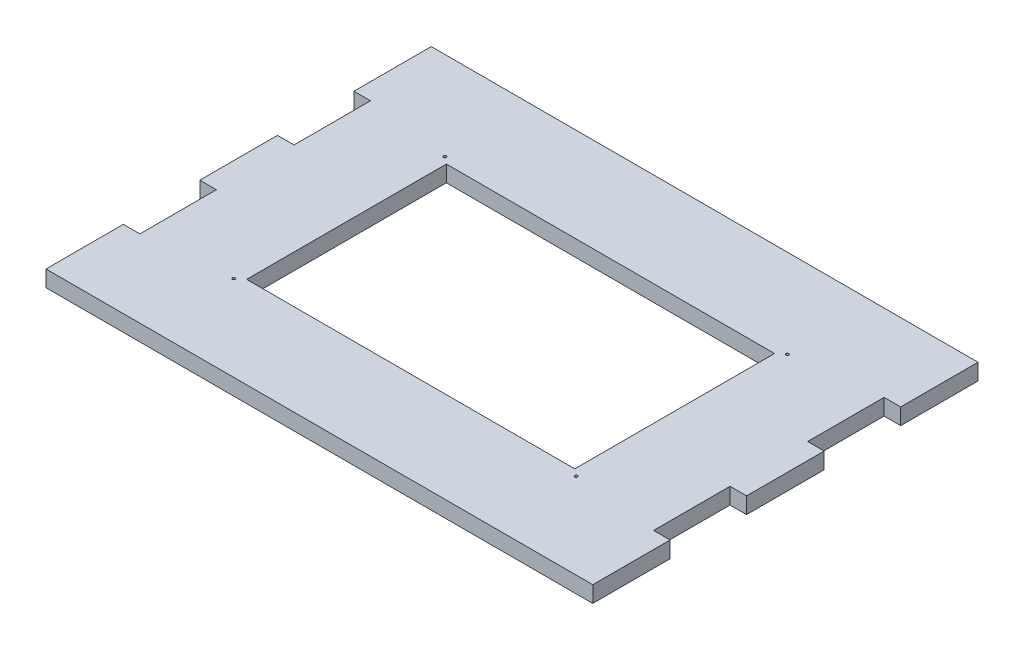
ISO-10303-21;
HEADER;
FILE_DESCRIPTION(('STEP AP214'),'2;1');
FILE_NAME('part.step','',(''),(''),'','','');
FILE_SCHEMA(('AUTOMOTIVE_DESIGN { 1 0 10303 214 1 1 1 1 }'));
ENDSEC;
DATA;
#1=APPLICATION_CONTEXT('core data for automotive mechanical design processes');
#2=APPLICATION_PROTOCOL_DEFINITION('international standard','automotive_design',2000,#1);
#3=PRODUCT_CONTEXT('',#1,'mechanical');
#4=PRODUCT('Part','Part','',(#3));
#5=PRODUCT_RELATED_PRODUCT_CATEGORY('part','',(#4));
#6=PRODUCT_DEFINITION_FORMATION('','',#4);
#7=PRODUCT_DEFINITION_CONTEXT('part definition',#1,'design');
#8=PRODUCT_DEFINITION('design','',#6,#7);
#9=PRODUCT_DEFINITION_SHAPE('','',#8);
#10=(LENGTH_UNIT() NAMED_UNIT(*) SI_UNIT(.MILLI.,.METRE.));
#11=(NAMED_UNIT(*) PLANE_ANGLE_UNIT() SI_UNIT($,.RADIAN.));
#12=(NAMED_UNIT(*) SI_UNIT($,.STERADIAN.) SOLID_ANGLE_UNIT());
#13=UNCERTAINTY_MEASURE_WITH_UNIT(LENGTH_MEASURE(1.E-05),#10,'distance_accuracy_value','');
#14=(GEOMETRIC_REPRESENTATION_CONTEXT(3) GLOBAL_UNCERTAINTY_ASSIGNED_CONTEXT((#13)) GLOBAL_UNIT_ASSIGNED_CONTEXT((#10,
#11,#12)) REPRESENTATION_CONTEXT('',''));
#15=CARTESIAN_POINT('',(0.,0.,0.));
#16=DIRECTION('',(0.,0.,1.));
#17=DIRECTION('',(1.,0.,0.));
#18=AXIS2_PLACEMENT_3D('',#15,#16,#17);
#19=CARTESIAN_POINT('',(0.,5.7,0.));
#20=DIRECTION('',(0.,-1.,0.));
#21=DIRECTION('',(0.,0.,-1.));
#22=AXIS2_PLACEMENT_3D('',#19,#20,#21);
#23=PLANE('',#22);
#24=CARTESIAN_POINT('',(150.,5.7,-90.));
#25=DIRECTION('',(0.,-1.,0.));
#26=DIRECTION('',(0.,0.,-1.));
#27=AXIS2_PLACEMENT_3D('',#24,#25,#26);
#28=CIRCLE('',#27,0.499999999999999);
#29=CARTESIAN_POINT('',(150.,5.7,-90.5));
#30=VERTEX_POINT('',#29);
#31=EDGE_CURVE('E332',#30,#30,#28,.F.);
#32=ORIENTED_EDGE('',*,*,#31,.F.);
#33=EDGE_LOOP('',(#32));
#34=FACE_BOUND('',#33,.T.);
#35=CARTESIAN_POINT('',(150.,5.7,-16.));
#36=DIRECTION('',(0.,-1.,0.));
#37=DIRECTION('',(0.,0.,-1.));
#38=AXIS2_PLACEMENT_3D('',#35,#36,#37);
#39=CIRCLE('',#38,0.499999999999999);
#40=CARTESIAN_POINT('',(150.,5.7,-16.5));
#41=VERTEX_POINT('',#40);
#42=EDGE_CURVE('E338',#41,#41,#39,.F.);
#43=ORIENTED_EDGE('',*,*,#42,.F.);
#44=EDGE_LOOP('',(#43));
#45=FACE_BOUND('',#44,.T.);
#46=CARTESIAN_POINT('',(30.,5.7,-16.));
#47=DIRECTION('',(0.,-1.,0.));
#48=DIRECTION('',(0.,0.,-1.));
#49=AXIS2_PLACEMENT_3D('',#46,#47,#48);
#50=CIRCLE('',#49,0.499999999999999);
#51=CARTESIAN_POINT('',(30.,5.7,-16.5));
#52=VERTEX_POINT('',#51);
#53=EDGE_CURVE('E344',#52,#52,#50,.F.);
#54=ORIENTED_EDGE('',*,*,#53,.F.);
#55=EDGE_LOOP('',(#54));
#56=FACE_BOUND('',#55,.T.);
#57=CARTESIAN_POINT('',(30.,5.7,-90.));
#58=DIRECTION('',(0.,-1.,0.));
#59=DIRECTION('',(0.,0.,-1.));
#60=AXIS2_PLACEMENT_3D('',#57,#58,#59);
#61=CIRCLE('',#60,0.499999999999999);
#62=CARTESIAN_POINT('',(30.,5.7,-90.5));
#63=VERTEX_POINT('',#62);
#64=EDGE_CURVE('E350',#63,#63,#61,.F.);
#65=ORIENTED_EDGE('',*,*,#64,.F.);
#66=EDGE_LOOP('',(#65));
#67=FACE_BOUND('',#66,.T.);
#68=DIRECTION('',(0.,0.,-1.));
#69=VECTOR('',#68,1.);
#70=CARTESIAN_POINT('',(147.5,5.7,0.));
#71=LINE('',#70,#69);
#72=CARTESIAN_POINT('',(147.5,5.7,-18.));
#73=VERTEX_POINT('',#72);
#74=CARTESIAN_POINT('',(147.5,5.7,-88.));
#75=VERTEX_POINT('',#74);
#76=EDGE_CURVE('E381',#73,#75,#71,.T.);
#77=ORIENTED_EDGE('',*,*,#76,.F.);
#78=DIRECTION('',(1.,0.,0.));
#79=VECTOR('',#78,1.);
#80=CARTESIAN_POINT('',(0.,5.7,-18.));
#81=LINE('',#80,#79);
#82=CARTESIAN_POINT('',(32.5,5.7,-18.));
#83=VERTEX_POINT('',#82);
#84=EDGE_CURVE('E374',#83,#73,#81,.T.);
#85=ORIENTED_EDGE('',*,*,#84,.F.);
#86=DIRECTION('',(0.,0.,1.));
#87=VECTOR('',#86,1.);
#88=CARTESIAN_POINT('',(32.5,5.7,0.));
#89=LINE('',#88,#87);
#90=CARTESIAN_POINT('',(32.5,5.7,-88.));
#91=VERTEX_POINT('',#90);
#92=EDGE_CURVE('E376',#91,#83,#89,.T.);
#93=ORIENTED_EDGE('',*,*,#92,.F.);
#94=DIRECTION('',(-1.,0.,0.));
#95=VECTOR('',#94,1.);
#96=CARTESIAN_POINT('',(0.,5.7,-88.));
#97=LINE('',#96,#95);
#98=EDGE_CURVE('E379',#75,#91,#97,.T.);
#99=ORIENTED_EDGE('',*,*,#98,.F.);
#100=EDGE_LOOP('',(#77,#85,#93,#99));
#101=FACE_BOUND('',#100,.T.);
#102=DIRECTION('',(0.,0.,1.));
#103=VECTOR('',#102,1.);
#104=CARTESIAN_POINT('',(185.8,5.7,0.));
#105=LINE('',#104,#103);
#106=CARTESIAN_POINT('',(185.8,5.7,-121.));
#107=VERTEX_POINT('',#106);
#108=CARTESIAN_POINT('',(185.8,5.7,-93.9));
#109=VERTEX_POINT('',#108);
#110=EDGE_CURVE('E196',#107,#109,#105,.T.);
#111=ORIENTED_EDGE('',*,*,#110,.F.);
#112=DIRECTION('',(-1.,0.,0.));
#113=VECTOR('',#112,1.);
#114=CARTESIAN_POINT('',(-6.,5.7,-121.));
#115=LINE('',#114,#113);
#116=CARTESIAN_POINT('',(-5.8,5.7,-121.));
#117=VERTEX_POINT('',#116);
#118=EDGE_CURVE('E56',#107,#117,#115,.T.);
#119=ORIENTED_EDGE('',*,*,#118,.T.);
#120=DIRECTION('',(0.,0.,-1.));
#121=VECTOR('',#120,1.);
#122=CARTESIAN_POINT('',(-5.8,5.7,0.));
#123=LINE('',#122,#121);
#124=CARTESIAN_POINT('',(-5.8,5.7,-93.9));
#125=VERTEX_POINT('',#124);
#126=EDGE_CURVE('E311',#125,#117,#123,.T.);
#127=ORIENTED_EDGE('',*,*,#126,.F.);
#128=DIRECTION('',(-1.,0.,0.));
#129=VECTOR('',#128,1.);
#130=CARTESIAN_POINT('',(0.,5.7,-93.9));
#131=LINE('',#130,#129);
#132=CARTESIAN_POINT('',(0.,5.7,-93.9));
#133=VERTEX_POINT('',#132);
#134=EDGE_CURVE('E315',#133,#125,#131,.T.);
#135=ORIENTED_EDGE('',*,*,#134,.F.);
#136=DIRECTION('',(0.,0.,-1.));
#137=VECTOR('',#136,1.);
#138=CARTESIAN_POINT('',(0.,5.7,0.));
#139=LINE('',#138,#137);
#140=CARTESIAN_POINT('',(0.,5.7,-67.1));
#141=VERTEX_POINT('',#140);
#142=EDGE_CURVE('E317',#141,#133,#139,.T.);
#143=ORIENTED_EDGE('',*,*,#142,.F.);
#144=DIRECTION('',(1.,0.,0.));
#145=VECTOR('',#144,1.);
#146=CARTESIAN_POINT('',(0.,5.7,-67.1));
#147=LINE('',#146,#145);
#148=CARTESIAN_POINT('',(-5.8,5.7,-67.1));
#149=VERTEX_POINT('',#148);
#150=EDGE_CURVE('E319',#149,#141,#147,.T.);
#151=ORIENTED_EDGE('',*,*,#150,.F.);
#152=DIRECTION('',(0.,0.,-1.));
#153=VECTOR('',#152,1.);
#154=CARTESIAN_POINT('',(-5.8,5.7,0.));
#155=LINE('',#154,#153);
#156=CARTESIAN_POINT('',(-5.8,5.7,-39.9));
#157=VERTEX_POINT('',#156);
#158=EDGE_CURVE('E321',#157,#149,#155,.T.);
#159=ORIENTED_EDGE('',*,*,#158,.F.);
#160=DIRECTION('',(-1.,0.,0.));
#161=VECTOR('',#160,1.);
#162=CARTESIAN_POINT('',(0.,5.7,-39.9));
#163=LINE('',#162,#161);
#164=CARTESIAN_POINT('',(0.,5.7,-39.9));
#165=VERTEX_POINT('',#164);
#166=EDGE_CURVE('E323',#165,#157,#163,.T.);
#167=ORIENTED_EDGE('',*,*,#166,.F.);
#168=DIRECTION('',(0.,0.,-1.));
#169=VECTOR('',#168,1.);
#170=CARTESIAN_POINT('',(0.,5.7,0.));
#171=LINE('',#170,#169);
#172=CARTESIAN_POINT('',(0.,5.7,-13.1));
#173=VERTEX_POINT('',#172);
#174=EDGE_CURVE('E325',#173,#165,#171,.T.);
#175=ORIENTED_EDGE('',*,*,#174,.F.);
#176=DIRECTION('',(1.,0.,0.));
#177=VECTOR('',#176,1.);
#178=CARTESIAN_POINT('',(0.,5.7,-13.1));
#179=LINE('',#178,#177);
#180=CARTESIAN_POINT('',(-5.8,5.7,-13.1));
#181=VERTEX_POINT('',#180);
#182=EDGE_CURVE('E327',#181,#173,#179,.T.);
#183=ORIENTED_EDGE('',*,*,#182,.F.);
#184=DIRECTION('',(0.,0.,-1.));
#185=VECTOR('',#184,1.);
#186=CARTESIAN_POINT('',(-5.8,5.7,0.));
#187=LINE('',#186,#185);
#188=CARTESIAN_POINT('',(-5.8,5.7,14.));
#189=VERTEX_POINT('',#188);
#190=EDGE_CURVE('E313',#189,#181,#187,.T.);
#191=ORIENTED_EDGE('',*,*,#190,.F.);
#192=DIRECTION('',(1.,0.,0.));
#193=VECTOR('',#192,1.);
#194=CARTESIAN_POINT('',(-6.,5.7,14.));
#195=LINE('',#194,#193);
#196=CARTESIAN_POINT('',(185.8,5.7,14.));
#197=VERTEX_POINT('',#196);
#198=EDGE_CURVE('E384',#189,#197,#195,.T.);
#199=ORIENTED_EDGE('',*,*,#198,.T.);
#200=DIRECTION('',(0.,0.,1.));
#201=VECTOR('',#200,1.);
#202=CARTESIAN_POINT('',(185.8,5.7,0.));
#203=LINE('',#202,#201);
#204=CARTESIAN_POINT('',(185.8,5.7,-13.1));
#205=VERTEX_POINT('',#204);
#206=EDGE_CURVE('E253',#205,#197,#203,.T.);
#207=ORIENTED_EDGE('',*,*,#206,.F.);
#208=DIRECTION('',(1.,0.,0.));
#209=VECTOR('',#208,1.);
#210=CARTESIAN_POINT('',(0.,5.7,-13.1));
#211=LINE('',#210,#209);
#212=CARTESIAN_POINT('',(180.,5.7,-13.1));
#213=VERTEX_POINT('',#212);
#214=EDGE_CURVE('E255',#213,#205,#211,.T.);
#215=ORIENTED_EDGE('',*,*,#214,.F.);
#216=DIRECTION('',(0.,0.,1.));
#217=VECTOR('',#216,1.);
#218=CARTESIAN_POINT('',(180.,5.7,0.));
#219=LINE('',#218,#217);
#220=CARTESIAN_POINT('',(180.,5.7,-39.9));
#221=VERTEX_POINT('',#220);
#222=EDGE_CURVE('E257',#221,#213,#219,.T.);
#223=ORIENTED_EDGE('',*,*,#222,.F.);
#224=DIRECTION('',(-1.,0.,0.));
#225=VECTOR('',#224,1.);
#226=CARTESIAN_POINT('',(0.,5.7,-39.9));
#227=LINE('',#226,#225);
#228=CARTESIAN_POINT('',(185.8,5.7,-39.9));
#229=VERTEX_POINT('',#228);
#230=EDGE_CURVE('E259',#229,#221,#227,.T.);
#231=ORIENTED_EDGE('',*,*,#230,.F.);
#232=DIRECTION('',(0.,0.,1.));
#233=VECTOR('',#232,1.);
#234=CARTESIAN_POINT('',(185.8,5.7,0.));
#235=LINE('',#234,#233);
#236=CARTESIAN_POINT('',(185.8,5.7,-67.1));
#237=VERTEX_POINT('',#236);
#238=EDGE_CURVE('E261',#237,#229,#235,.T.);
#239=ORIENTED_EDGE('',*,*,#238,.F.);
#240=DIRECTION('',(1.,0.,0.));
#241=VECTOR('',#240,1.);
#242=CARTESIAN_POINT('',(0.,5.7,-67.1));
#243=LINE('',#242,#241);
#244=CARTESIAN_POINT('',(180.,5.7,-67.1));
#245=VERTEX_POINT('',#244);
#246=EDGE_CURVE('E263',#245,#237,#243,.T.);
#247=ORIENTED_EDGE('',*,*,#246,.F.);
#248=DIRECTION('',(0.,0.,1.));
#249=VECTOR('',#248,1.);
#250=CARTESIAN_POINT('',(180.,5.7,-1.86418045179597E-13));
#251=LINE('',#250,#249);
#252=CARTESIAN_POINT('',(180.,5.7,-93.9));
#253=VERTEX_POINT('',#252);
#254=EDGE_CURVE('E265',#253,#245,#251,.T.);
#255=ORIENTED_EDGE('',*,*,#254,.F.);
#256=DIRECTION('',(-1.,0.,0.));
#257=VECTOR('',#256,1.);
#258=CARTESIAN_POINT('',(0.,5.7,-93.9));
#259=LINE('',#258,#257);
#260=EDGE_CURVE('E267',#109,#253,#259,.T.);
#261=ORIENTED_EDGE('',*,*,#260,.F.);
#262=EDGE_LOOP('',(#111,#119,#127,#135,#143,#151,#159,#167,#175,#183,#191,#199,#207,#215,#223,
#231,#239,#247,#255,#261));
#263=FACE_BOUND('',#262,.T.);
#264=ADVANCED_FACE('F33',(#34,#45,#56,#67,#101,#263),#23,.F.);
#265=CARTESIAN_POINT('',(0.,0.,0.));
#266=DIRECTION('',(0.,-1.,0.));
#267=DIRECTION('',(0.,0.,-1.));
#268=AXIS2_PLACEMENT_3D('',#265,#266,#267);
#269=PLANE('',#268);
#270=CARTESIAN_POINT('',(150.,0.,-90.));
#271=DIRECTION('',(0.,1.,0.));
#272=DIRECTION('',(0.,0.,1.));
#273=AXIS2_PLACEMENT_3D('',#270,#271,#272);
#274=CIRCLE('',#273,0.499999999999999);
#275=CARTESIAN_POINT('',(150.,0.,-89.5));
#276=VERTEX_POINT('',#275);
#277=EDGE_CURVE('E329',#276,#276,#274,.T.);
#278=ORIENTED_EDGE('',*,*,#277,.T.);
#279=EDGE_LOOP('',(#278));
#280=FACE_BOUND('',#279,.T.);
#281=CARTESIAN_POINT('',(150.,0.,-16.));
#282=DIRECTION('',(0.,1.,0.));
#283=DIRECTION('',(0.,0.,1.));
#284=AXIS2_PLACEMENT_3D('',#281,#282,#283);
#285=CIRCLE('',#284,0.499999999999999);
#286=CARTESIAN_POINT('',(150.,0.,-15.5));
#287=VERTEX_POINT('',#286);
#288=EDGE_CURVE('E335',#287,#287,#285,.T.);
#289=ORIENTED_EDGE('',*,*,#288,.T.);
#290=EDGE_LOOP('',(#289));
#291=FACE_BOUND('',#290,.T.);
#292=CARTESIAN_POINT('',(30.,0.,-16.));
#293=DIRECTION('',(0.,1.,0.));
#294=DIRECTION('',(0.,0.,1.));
#295=AXIS2_PLACEMENT_3D('',#292,#293,#294);
#296=CIRCLE('',#295,0.499999999999999);
#297=CARTESIAN_POINT('',(30.,0.,-15.5));
#298=VERTEX_POINT('',#297);
#299=EDGE_CURVE('E341',#298,#298,#296,.T.);
#300=ORIENTED_EDGE('',*,*,#299,.T.);
#301=EDGE_LOOP('',(#300));
#302=FACE_BOUND('',#301,.T.);
#303=CARTESIAN_POINT('',(30.,0.,-90.));
#304=DIRECTION('',(0.,1.,0.));
#305=DIRECTION('',(0.,0.,1.));
#306=AXIS2_PLACEMENT_3D('',#303,#304,#305);
#307=CIRCLE('',#306,0.499999999999999);
#308=CARTESIAN_POINT('',(30.,0.,-89.5));
#309=VERTEX_POINT('',#308);
#310=EDGE_CURVE('E347',#309,#309,#307,.T.);
#311=ORIENTED_EDGE('',*,*,#310,.T.);
#312=EDGE_LOOP('',(#311));
#313=FACE_BOUND('',#312,.T.);
#314=DIRECTION('',(1.,0.,0.));
#315=VECTOR('',#314,1.);
#316=CARTESIAN_POINT('',(32.5,0.,-18.));
#317=LINE('',#316,#315);
#318=CARTESIAN_POINT('',(32.5,0.,-18.));
#319=VERTEX_POINT('',#318);
#320=CARTESIAN_POINT('',(147.5,0.,-18.));
#321=VERTEX_POINT('',#320);
#322=EDGE_CURVE('E362',#319,#321,#317,.T.);
#323=ORIENTED_EDGE('',*,*,#322,.T.);
#324=DIRECTION('',(0.,0.,-1.));
#325=VECTOR('',#324,1.);
#326=CARTESIAN_POINT('',(147.5,0.,-88.));
#327=LINE('',#326,#325);
#328=CARTESIAN_POINT('',(147.5,0.,-88.));
#329=VERTEX_POINT('',#328);
#330=EDGE_CURVE('E353',#321,#329,#327,.T.);
#331=ORIENTED_EDGE('',*,*,#330,.T.);
#332=DIRECTION('',(-1.,0.,0.));
#333=VECTOR('',#332,1.);
#334=CARTESIAN_POINT('',(32.5,0.,-88.));
#335=LINE('',#334,#333);
#336=CARTESIAN_POINT('',(32.5,0.,-88.));
#337=VERTEX_POINT('',#336);
#338=EDGE_CURVE('E356',#329,#337,#335,.T.);
#339=ORIENTED_EDGE('',*,*,#338,.T.);
#340=DIRECTION('',(0.,0.,1.));
#341=VECTOR('',#340,1.);
#342=CARTESIAN_POINT('',(32.5,0.,-88.));
#343=LINE('',#342,#341);
#344=EDGE_CURVE('E359',#337,#319,#343,.T.);
#345=ORIENTED_EDGE('',*,*,#344,.T.);
#346=EDGE_LOOP('',(#323,#331,#339,#345));
#347=FACE_BOUND('',#346,.T.);
#348=DIRECTION('',(-1.,0.,0.));
#349=VECTOR('',#348,1.);
#350=CARTESIAN_POINT('',(-6.,0.,-121.));
#351=LINE('',#350,#349);
#352=CARTESIAN_POINT('',(185.8,0.,-121.));
#353=VERTEX_POINT('',#352);
#354=CARTESIAN_POINT('',(-5.8,0.,-121.));
#355=VERTEX_POINT('',#354);
#356=EDGE_CURVE('E214',#353,#355,#351,.T.);
#357=ORIENTED_EDGE('',*,*,#356,.F.);
#358=DIRECTION('',(0.,0.,1.));
#359=VECTOR('',#358,1.);
#360=CARTESIAN_POINT('',(185.8,0.,-121.));
#361=LINE('',#360,#359);
#362=CARTESIAN_POINT('',(185.8,0.,-93.9));
#363=VERTEX_POINT('',#362);
#364=EDGE_CURVE('E48',#353,#363,#361,.T.);
#365=ORIENTED_EDGE('',*,*,#364,.T.);
#366=DIRECTION('',(-1.,0.,0.));
#367=VECTOR('',#366,1.);
#368=CARTESIAN_POINT('',(185.8,0.,-93.9));
#369=LINE('',#368,#367);
#370=CARTESIAN_POINT('',(180.,0.,-93.9));
#371=VERTEX_POINT('',#370);
#372=EDGE_CURVE('E203',#363,#371,#369,.T.);
#373=ORIENTED_EDGE('',*,*,#372,.T.);
#374=DIRECTION('',(0.,0.,1.));
#375=VECTOR('',#374,1.);
#376=CARTESIAN_POINT('',(180.,0.,-93.9));
#377=LINE('',#376,#375);
#378=CARTESIAN_POINT('',(180.,0.,-67.1));
#379=VERTEX_POINT('',#378);
#380=EDGE_CURVE('E209',#371,#379,#377,.T.);
#381=ORIENTED_EDGE('',*,*,#380,.T.);
#382=DIRECTION('',(1.,0.,0.));
#383=VECTOR('',#382,1.);
#384=CARTESIAN_POINT('',(180.,0.,-67.1));
#385=LINE('',#384,#383);
#386=CARTESIAN_POINT('',(185.8,0.,-67.1));
#387=VERTEX_POINT('',#386);
#388=EDGE_CURVE('E218',#379,#387,#385,.T.);
#389=ORIENTED_EDGE('',*,*,#388,.T.);
#390=DIRECTION('',(0.,0.,1.));
#391=VECTOR('',#390,1.);
#392=CARTESIAN_POINT('',(185.8,0.,-67.1));
#393=LINE('',#392,#391);
#394=CARTESIAN_POINT('',(185.8,0.,-39.9));
#395=VERTEX_POINT('',#394);
#396=EDGE_CURVE('E221',#387,#395,#393,.T.);
#397=ORIENTED_EDGE('',*,*,#396,.T.);
#398=DIRECTION('',(-1.,0.,0.));
#399=VECTOR('',#398,1.);
#400=CARTESIAN_POINT('',(185.8,0.,-39.9));
#401=LINE('',#400,#399);
#402=CARTESIAN_POINT('',(180.,0.,-39.9));
#403=VERTEX_POINT('',#402);
#404=EDGE_CURVE('E224',#395,#403,#401,.T.);
#405=ORIENTED_EDGE('',*,*,#404,.T.);
#406=DIRECTION('',(0.,0.,1.));
#407=VECTOR('',#406,1.);
#408=CARTESIAN_POINT('',(180.,0.,-39.9));
#409=LINE('',#408,#407);
#410=CARTESIAN_POINT('',(180.,0.,-13.1));
#411=VERTEX_POINT('',#410);
#412=EDGE_CURVE('E227',#403,#411,#409,.T.);
#413=ORIENTED_EDGE('',*,*,#412,.T.);
#414=DIRECTION('',(1.,0.,0.));
#415=VECTOR('',#414,1.);
#416=CARTESIAN_POINT('',(180.,0.,-13.1));
#417=LINE('',#416,#415);
#418=CARTESIAN_POINT('',(185.8,0.,-13.1));
#419=VERTEX_POINT('',#418);
#420=EDGE_CURVE('E230',#411,#419,#417,.T.);
#421=ORIENTED_EDGE('',*,*,#420,.T.);
#422=DIRECTION('',(0.,0.,1.));
#423=VECTOR('',#422,1.);
#424=CARTESIAN_POINT('',(185.8,0.,-13.1));
#425=LINE('',#424,#423);
#426=CARTESIAN_POINT('',(185.8,0.,14.));
#427=VERTEX_POINT('',#426);
#428=EDGE_CURVE('E233',#419,#427,#425,.T.);
#429=ORIENTED_EDGE('',*,*,#428,.T.);
#430=DIRECTION('',(1.,0.,0.));
#431=VECTOR('',#430,1.);
#432=CARTESIAN_POINT('',(-6.,0.,14.));
#433=LINE('',#432,#431);
#434=CARTESIAN_POINT('',(-5.8,0.,14.));
#435=VERTEX_POINT('',#434);
#436=EDGE_CURVE('E383',#435,#427,#433,.T.);
#437=ORIENTED_EDGE('',*,*,#436,.F.);
#438=DIRECTION('',(0.,0.,-1.));
#439=VECTOR('',#438,1.);
#440=CARTESIAN_POINT('',(-5.8,0.,-13.1));
#441=LINE('',#440,#439);
#442=CARTESIAN_POINT('',(-5.8,0.,-13.1));
#443=VERTEX_POINT('',#442);
#444=EDGE_CURVE('E269',#435,#443,#441,.T.);
#445=ORIENTED_EDGE('',*,*,#444,.T.);
#446=DIRECTION('',(1.,0.,0.));
#447=VECTOR('',#446,1.);
#448=CARTESIAN_POINT('',(0.,0.,-13.1));
#449=LINE('',#448,#447);
#450=CARTESIAN_POINT('',(0.,0.,-13.1));
#451=VERTEX_POINT('',#450);
#452=EDGE_CURVE('E272',#443,#451,#449,.T.);
#453=ORIENTED_EDGE('',*,*,#452,.T.);
#454=DIRECTION('',(0.,0.,-1.));
#455=VECTOR('',#454,1.);
#456=CARTESIAN_POINT('',(0.,0.,-39.9));
#457=LINE('',#456,#455);
#458=CARTESIAN_POINT('',(0.,0.,-39.9));
#459=VERTEX_POINT('',#458);
#460=EDGE_CURVE('E275',#451,#459,#457,.T.);
#461=ORIENTED_EDGE('',*,*,#460,.T.);
#462=DIRECTION('',(-1.,0.,0.));
#463=VECTOR('',#462,1.);
#464=CARTESIAN_POINT('',(-5.8,0.,-39.9));
#465=LINE('',#464,#463);
#466=CARTESIAN_POINT('',(-5.8,0.,-39.9));
#467=VERTEX_POINT('',#466);
#468=EDGE_CURVE('E278',#459,#467,#465,.T.);
#469=ORIENTED_EDGE('',*,*,#468,.T.);
#470=DIRECTION('',(0.,0.,-1.));
#471=VECTOR('',#470,1.);
#472=CARTESIAN_POINT('',(-5.8,0.,-67.1));
#473=LINE('',#472,#471);
#474=CARTESIAN_POINT('',(-5.8,0.,-67.1));
#475=VERTEX_POINT('',#474);
#476=EDGE_CURVE('E281',#467,#475,#473,.T.);
#477=ORIENTED_EDGE('',*,*,#476,.T.);
#478=DIRECTION('',(1.,0.,0.));
#479=VECTOR('',#478,1.);
#480=CARTESIAN_POINT('',(0.,0.,-67.1));
#481=LINE('',#480,#479);
#482=CARTESIAN_POINT('',(0.,0.,-67.1));
#483=VERTEX_POINT('',#482);
#484=EDGE_CURVE('E284',#475,#483,#481,.T.);
#485=ORIENTED_EDGE('',*,*,#484,.T.);
#486=DIRECTION('',(0.,0.,-1.));
#487=VECTOR('',#486,1.);
#488=CARTESIAN_POINT('',(0.,0.,-93.9));
#489=LINE('',#488,#487);
#490=CARTESIAN_POINT('',(0.,0.,-93.9));
#491=VERTEX_POINT('',#490);
#492=EDGE_CURVE('E287',#483,#491,#489,.T.);
#493=ORIENTED_EDGE('',*,*,#492,.T.);
#494=DIRECTION('',(-1.,0.,0.));
#495=VECTOR('',#494,1.);
#496=CARTESIAN_POINT('',(-5.8,0.,-93.9));
#497=LINE('',#496,#495);
#498=CARTESIAN_POINT('',(-5.8,0.,-93.9));
#499=VERTEX_POINT('',#498);
#500=EDGE_CURVE('E290',#491,#499,#497,.T.);
#501=ORIENTED_EDGE('',*,*,#500,.T.);
#502=DIRECTION('',(0.,0.,-1.));
#503=VECTOR('',#502,1.);
#504=CARTESIAN_POINT('',(-5.8,0.,-121.));
#505=LINE('',#504,#503);
#506=EDGE_CURVE('E293',#499,#355,#505,.T.);
#507=ORIENTED_EDGE('',*,*,#506,.T.);
#508=EDGE_LOOP('',(#357,#365,#373,#381,#389,#397,#405,#413,#421,#429,#437,#445,#453,#461,#469,
#477,#485,#493,#501,#507));
#509=FACE_BOUND('',#508,.T.);
#510=ADVANCED_FACE('F212',(#280,#291,#302,#313,#347,#509),#269,.T.);
#511=CARTESIAN_POINT('',(-6.,5.7,14.));
#512=DIRECTION('',(0.,0.,-1.));
#513=DIRECTION('',(-1.,0.,0.));
#514=AXIS2_PLACEMENT_3D('',#511,#512,#513);
#515=PLANE('',#514);
#516=DIRECTION('',(0.,-1.,0.));
#517=VECTOR('',#516,1.);
#518=CARTESIAN_POINT('',(185.8,11.,14.));
#519=LINE('',#518,#517);
#520=EDGE_CURVE('E236',#197,#427,#519,.T.);
#521=ORIENTED_EDGE('',*,*,#520,.F.);
#522=ORIENTED_EDGE('',*,*,#198,.F.);
#523=DIRECTION('',(0.,1.,0.));
#524=VECTOR('',#523,1.);
#525=CARTESIAN_POINT('',(-5.8,5.7,14.));
#526=LINE('',#525,#524);
#527=EDGE_CURVE('E11',#435,#189,#526,.T.);
#528=ORIENTED_EDGE('',*,*,#527,.F.);
#529=ORIENTED_EDGE('',*,*,#436,.T.);
#530=EDGE_LOOP('',(#521,#522,#528,#529));
#531=FACE_BOUND('',#530,.T.);
#532=ADVANCED_FACE('F35',(#531),#515,.F.);
#533=CARTESIAN_POINT('',(-6.,5.7,-121.));
#534=DIRECTION('',(0.,0.,1.));
#535=DIRECTION('',(1.,0.,0.));
#536=AXIS2_PLACEMENT_3D('',#533,#534,#535);
#537=PLANE('',#536);
#538=DIRECTION('',(0.,-1.,0.));
#539=VECTOR('',#538,1.);
#540=CARTESIAN_POINT('',(185.8,11.,-121.));
#541=LINE('',#540,#539);
#542=EDGE_CURVE('E199',#107,#353,#541,.T.);
#543=ORIENTED_EDGE('',*,*,#542,.T.);
#544=ORIENTED_EDGE('',*,*,#356,.T.);
#545=DIRECTION('',(0.,-1.,0.));
#546=VECTOR('',#545,1.);
#547=CARTESIAN_POINT('',(-5.8,5.7,-121.));
#548=LINE('',#547,#546);
#549=EDGE_CURVE('E41',#117,#355,#548,.T.);
#550=ORIENTED_EDGE('',*,*,#549,.F.);
#551=ORIENTED_EDGE('',*,*,#118,.F.);
#552=EDGE_LOOP('',(#543,#544,#550,#551));
#553=FACE_BOUND('',#552,.T.);
#554=ADVANCED_FACE('F493',(#553),#537,.F.);
#555=CARTESIAN_POINT('',(147.5,47.,-88.));
#556=DIRECTION('',(-1.,0.,0.));
#557=DIRECTION('',(0.,0.,1.));
#558=AXIS2_PLACEMENT_3D('',#555,#556,#557);
#559=PLANE('',#558);
#560=ORIENTED_EDGE('',*,*,#76,.T.);
#561=DIRECTION('',(0.,-1.,0.));
#562=VECTOR('',#561,1.);
#563=CARTESIAN_POINT('',(147.5,47.,-88.));
#564=LINE('',#563,#562);
#565=EDGE_CURVE('E372',#75,#329,#564,.T.);
#566=ORIENTED_EDGE('',*,*,#565,.T.);
#567=ORIENTED_EDGE('',*,*,#330,.F.);
#568=DIRECTION('',(0.,-1.,0.));
#569=VECTOR('',#568,1.);
#570=CARTESIAN_POINT('',(147.5,47.,-18.));
#571=LINE('',#570,#569);
#572=EDGE_CURVE('E365',#73,#321,#571,.T.);
#573=ORIENTED_EDGE('',*,*,#572,.F.);
#574=EDGE_LOOP('',(#560,#566,#567,#573));
#575=FACE_BOUND('',#574,.T.);
#576=ADVANCED_FACE('F491',(#575),#559,.T.);
#577=CARTESIAN_POINT('',(32.5,47.,-88.));
#578=DIRECTION('',(0.,0.,1.));
#579=DIRECTION('',(1.,0.,0.));
#580=AXIS2_PLACEMENT_3D('',#577,#578,#579);
#581=PLANE('',#580);
#582=ORIENTED_EDGE('',*,*,#98,.T.);
#583=DIRECTION('',(0.,-1.,0.));
#584=VECTOR('',#583,1.);
#585=CARTESIAN_POINT('',(32.5,47.,-88.));
#586=LINE('',#585,#584);
#587=EDGE_CURVE('E370',#91,#337,#586,.T.);
#588=ORIENTED_EDGE('',*,*,#587,.T.);
#589=ORIENTED_EDGE('',*,*,#338,.F.);
#590=ORIENTED_EDGE('',*,*,#565,.F.);
#591=EDGE_LOOP('',(#582,#588,#589,#590));
#592=FACE_BOUND('',#591,.T.);
#593=ADVANCED_FACE('F499',(#592),#581,.T.);
#594=CARTESIAN_POINT('',(32.5,47.,-88.));
#595=DIRECTION('',(1.,0.,0.));
#596=DIRECTION('',(0.,0.,-1.));
#597=AXIS2_PLACEMENT_3D('',#594,#595,#596);
#598=PLANE('',#597);
#599=ORIENTED_EDGE('',*,*,#92,.T.);
#600=DIRECTION('',(0.,-1.,0.));
#601=VECTOR('',#600,1.);
#602=CARTESIAN_POINT('',(32.5,47.,-18.));
#603=LINE('',#602,#601);
#604=EDGE_CURVE('E368',#83,#319,#603,.T.);
#605=ORIENTED_EDGE('',*,*,#604,.T.);
#606=ORIENTED_EDGE('',*,*,#344,.F.);
#607=ORIENTED_EDGE('',*,*,#587,.F.);
#608=EDGE_LOOP('',(#599,#605,#606,#607));
#609=FACE_BOUND('',#608,.T.);
#610=ADVANCED_FACE('F564',(#609),#598,.T.);
#611=CARTESIAN_POINT('',(32.5,47.,-18.));
#612=DIRECTION('',(0.,0.,-1.));
#613=DIRECTION('',(-1.,0.,0.));
#614=AXIS2_PLACEMENT_3D('',#611,#612,#613);
#615=PLANE('',#614);
#616=ORIENTED_EDGE('',*,*,#84,.T.);
#617=ORIENTED_EDGE('',*,*,#572,.T.);
#618=ORIENTED_EDGE('',*,*,#322,.F.);
#619=ORIENTED_EDGE('',*,*,#604,.F.);
#620=EDGE_LOOP('',(#616,#617,#618,#619));
#621=FACE_BOUND('',#620,.T.);
#622=ADVANCED_FACE('F554',(#621),#615,.T.);
#623=CARTESIAN_POINT('',(30.,37.,-90.));
#624=DIRECTION('',(0.,-1.,0.));
#625=DIRECTION('',(0.,0.,-1.));
#626=AXIS2_PLACEMENT_3D('',#623,#624,#625);
#627=CYLINDRICAL_SURFACE('',#626,0.499999999999999);
#628=ORIENTED_EDGE('',*,*,#310,.F.);
#629=EDGE_LOOP('',(#628));
#630=FACE_BOUND('',#629,.T.);
#631=ORIENTED_EDGE('',*,*,#64,.T.);
#632=EDGE_LOOP('',(#631));
#633=FACE_BOUND('',#632,.T.);
#634=ADVANCED_FACE('F544',(#630,#633),#627,.F.);
#635=CARTESIAN_POINT('',(30.,37.,-16.));
#636=DIRECTION('',(0.,-1.,0.));
#637=DIRECTION('',(0.,0.,-1.));
#638=AXIS2_PLACEMENT_3D('',#635,#636,#637);
#639=CYLINDRICAL_SURFACE('',#638,0.499999999999999);
#640=ORIENTED_EDGE('',*,*,#299,.F.);
#641=EDGE_LOOP('',(#640));
#642=FACE_BOUND('',#641,.T.);
#643=ORIENTED_EDGE('',*,*,#53,.T.);
#644=EDGE_LOOP('',(#643));
#645=FACE_BOUND('',#644,.T.);
#646=ADVANCED_FACE('F534',(#642,#645),#639,.F.);
#647=CARTESIAN_POINT('',(150.,37.,-16.));
#648=DIRECTION('',(0.,-1.,0.));
#649=DIRECTION('',(0.,0.,-1.));
#650=AXIS2_PLACEMENT_3D('',#647,#648,#649);
#651=CYLINDRICAL_SURFACE('',#650,0.499999999999999);
#652=ORIENTED_EDGE('',*,*,#288,.F.);
#653=EDGE_LOOP('',(#652));
#654=FACE_BOUND('',#653,.T.);
#655=ORIENTED_EDGE('',*,*,#42,.T.);
#656=EDGE_LOOP('',(#655));
#657=FACE_BOUND('',#656,.T.);
#658=ADVANCED_FACE('F522',(#654,#657),#651,.F.);
#659=CARTESIAN_POINT('',(150.,37.,-90.));
#660=DIRECTION('',(0.,-1.,0.));
#661=DIRECTION('',(0.,0.,-1.));
#662=AXIS2_PLACEMENT_3D('',#659,#660,#661);
#663=CYLINDRICAL_SURFACE('',#662,0.499999999999999);
#664=ORIENTED_EDGE('',*,*,#277,.F.);
#665=EDGE_LOOP('',(#664));
#666=FACE_BOUND('',#665,.T.);
#667=ORIENTED_EDGE('',*,*,#31,.T.);
#668=EDGE_LOOP('',(#667));
#669=FACE_BOUND('',#668,.T.);
#670=ADVANCED_FACE('F517',(#666,#669),#663,.F.);
#671=CARTESIAN_POINT('',(0.,11.,-13.1));
#672=DIRECTION('',(0.,0.,-1.));
#673=DIRECTION('',(-1.,0.,0.));
#674=AXIS2_PLACEMENT_3D('',#671,#672,#673);
#675=PLANE('',#674);
#676=ORIENTED_EDGE('',*,*,#182,.T.);
#677=DIRECTION('',(0.,-1.,0.));
#678=VECTOR('',#677,1.);
#679=CARTESIAN_POINT('',(0.,11.,-13.1));
#680=LINE('',#679,#678);
#681=EDGE_CURVE('E307',#173,#451,#680,.T.);
#682=ORIENTED_EDGE('',*,*,#681,.T.);
#683=ORIENTED_EDGE('',*,*,#452,.F.);
#684=DIRECTION('',(0.,-1.,0.));
#685=VECTOR('',#684,1.);
#686=CARTESIAN_POINT('',(-5.8,11.,-13.1));
#687=LINE('',#686,#685);
#688=EDGE_CURVE('E309',#181,#443,#687,.T.);
#689=ORIENTED_EDGE('',*,*,#688,.F.);
#690=EDGE_LOOP('',(#676,#682,#683,#689));
#691=FACE_BOUND('',#690,.T.);
#692=ADVANCED_FACE('F430',(#691),#675,.T.);
#693=CARTESIAN_POINT('',(0.,11.,-39.9));
#694=DIRECTION('',(-1.,0.,0.));
#695=DIRECTION('',(0.,0.,1.));
#696=AXIS2_PLACEMENT_3D('',#693,#694,#695);
#697=PLANE('',#696);
#698=ORIENTED_EDGE('',*,*,#174,.T.);
#699=DIRECTION('',(0.,-1.,0.));
#700=VECTOR('',#699,1.);
#701=CARTESIAN_POINT('',(0.,11.,-39.9));
#702=LINE('',#701,#700);
#703=EDGE_CURVE('E305',#165,#459,#702,.T.);
#704=ORIENTED_EDGE('',*,*,#703,.T.);
#705=ORIENTED_EDGE('',*,*,#460,.F.);
#706=ORIENTED_EDGE('',*,*,#681,.F.);
#707=EDGE_LOOP('',(#698,#704,#705,#706));
#708=FACE_BOUND('',#707,.T.);
#709=ADVANCED_FACE('F426',(#708),#697,.T.);
#710=CARTESIAN_POINT('',(-5.8,11.,-39.9));
#711=DIRECTION('',(0.,0.,1.));
#712=DIRECTION('',(1.,0.,0.));
#713=AXIS2_PLACEMENT_3D('',#710,#711,#712);
#714=PLANE('',#713);
#715=ORIENTED_EDGE('',*,*,#166,.T.);
#716=DIRECTION('',(0.,-1.,0.));
#717=VECTOR('',#716,1.);
#718=CARTESIAN_POINT('',(-5.8,11.,-39.9));
#719=LINE('',#718,#717);
#720=EDGE_CURVE('E303',#157,#467,#719,.T.);
#721=ORIENTED_EDGE('',*,*,#720,.T.);
#722=ORIENTED_EDGE('',*,*,#468,.F.);
#723=ORIENTED_EDGE('',*,*,#703,.F.);
#724=EDGE_LOOP('',(#715,#721,#722,#723));
#725=FACE_BOUND('',#724,.T.);
#726=ADVANCED_FACE('F422',(#725),#714,.T.);
#727=CARTESIAN_POINT('',(-5.8,11.,-67.1));
#728=DIRECTION('',(-1.,0.,0.));
#729=DIRECTION('',(0.,0.,1.));
#730=AXIS2_PLACEMENT_3D('',#727,#728,#729);
#731=PLANE('',#730);
#732=ORIENTED_EDGE('',*,*,#158,.T.);
#733=DIRECTION('',(0.,-1.,0.));
#734=VECTOR('',#733,1.);
#735=CARTESIAN_POINT('',(-5.8,11.,-67.1));
#736=LINE('',#735,#734);
#737=EDGE_CURVE('E301',#149,#475,#736,.T.);
#738=ORIENTED_EDGE('',*,*,#737,.T.);
#739=ORIENTED_EDGE('',*,*,#476,.F.);
#740=ORIENTED_EDGE('',*,*,#720,.F.);
#741=EDGE_LOOP('',(#732,#738,#739,#740));
#742=FACE_BOUND('',#741,.T.);
#743=ADVANCED_FACE('F415',(#742),#731,.T.);
#744=CARTESIAN_POINT('',(0.,11.,-67.1));
#745=DIRECTION('',(0.,0.,-1.));
#746=DIRECTION('',(-1.,0.,0.));
#747=AXIS2_PLACEMENT_3D('',#744,#745,#746);
#748=PLANE('',#747);
#749=ORIENTED_EDGE('',*,*,#150,.T.);
#750=DIRECTION('',(0.,-1.,0.));
#751=VECTOR('',#750,1.);
#752=CARTESIAN_POINT('',(0.,11.,-67.1));
#753=LINE('',#752,#751);
#754=EDGE_CURVE('E299',#141,#483,#753,.T.);
#755=ORIENTED_EDGE('',*,*,#754,.T.);
#756=ORIENTED_EDGE('',*,*,#484,.F.);
#757=ORIENTED_EDGE('',*,*,#737,.F.);
#758=EDGE_LOOP('',(#749,#755,#756,#757));
#759=FACE_BOUND('',#758,.T.);
#760=ADVANCED_FACE('F411',(#759),#748,.T.);
#761=CARTESIAN_POINT('',(0.,11.,-93.9));
#762=DIRECTION('',(-1.,0.,0.));
#763=DIRECTION('',(0.,0.,1.));
#764=AXIS2_PLACEMENT_3D('',#761,#762,#763);
#765=PLANE('',#764);
#766=ORIENTED_EDGE('',*,*,#142,.T.);
#767=DIRECTION('',(0.,-1.,0.));
#768=VECTOR('',#767,1.);
#769=CARTESIAN_POINT('',(0.,11.,-93.9));
#770=LINE('',#769,#768);
#771=EDGE_CURVE('E297',#133,#491,#770,.T.);
#772=ORIENTED_EDGE('',*,*,#771,.T.);
#773=ORIENTED_EDGE('',*,*,#492,.F.);
#774=ORIENTED_EDGE('',*,*,#754,.F.);
#775=EDGE_LOOP('',(#766,#772,#773,#774));
#776=FACE_BOUND('',#775,.T.);
#777=ADVANCED_FACE('F408',(#776),#765,.T.);
#778=CARTESIAN_POINT('',(-5.8,11.,-93.9));
#779=DIRECTION('',(0.,0.,1.));
#780=DIRECTION('',(1.,0.,0.));
#781=AXIS2_PLACEMENT_3D('',#778,#779,#780);
#782=PLANE('',#781);
#783=ORIENTED_EDGE('',*,*,#134,.T.);
#784=DIRECTION('',(0.,-1.,0.));
#785=VECTOR('',#784,1.);
#786=CARTESIAN_POINT('',(-5.8,11.,-93.9));
#787=LINE('',#786,#785);
#788=EDGE_CURVE('E295',#125,#499,#787,.T.);
#789=ORIENTED_EDGE('',*,*,#788,.T.);
#790=ORIENTED_EDGE('',*,*,#500,.F.);
#791=ORIENTED_EDGE('',*,*,#771,.F.);
#792=EDGE_LOOP('',(#783,#789,#790,#791));
#793=FACE_BOUND('',#792,.T.);
#794=ADVANCED_FACE('F401',(#793),#782,.T.);
#795=CARTESIAN_POINT('',(-5.8,11.,-13.1));
#796=DIRECTION('',(-1.,0.,0.));
#797=DIRECTION('',(0.,0.,1.));
#798=AXIS2_PLACEMENT_3D('',#795,#796,#797);
#799=PLANE('',#798);
#800=ORIENTED_EDGE('',*,*,#190,.T.);
#801=ORIENTED_EDGE('',*,*,#688,.T.);
#802=ORIENTED_EDGE('',*,*,#444,.F.);
#803=ORIENTED_EDGE('',*,*,#527,.T.);
#804=EDGE_LOOP('',(#800,#801,#802,#803));
#805=FACE_BOUND('',#804,.T.);
#806=ADVANCED_FACE('F593',(#805),#799,.T.);
#807=CARTESIAN_POINT('',(-5.8,11.,-121.));
#808=DIRECTION('',(-1.,0.,0.));
#809=DIRECTION('',(0.,0.,1.));
#810=AXIS2_PLACEMENT_3D('',#807,#808,#809);
#811=PLANE('',#810);
#812=ORIENTED_EDGE('',*,*,#126,.T.);
#813=ORIENTED_EDGE('',*,*,#549,.T.);
#814=ORIENTED_EDGE('',*,*,#506,.F.);
#815=ORIENTED_EDGE('',*,*,#788,.F.);
#816=EDGE_LOOP('',(#812,#813,#814,#815));
#817=FACE_BOUND('',#816,.T.);
#818=ADVANCED_FACE('F394',(#817),#811,.T.);
#819=CARTESIAN_POINT('',(185.8,11.,-93.9));
#820=DIRECTION('',(0.,0.,1.));
#821=DIRECTION('',(1.,0.,0.));
#822=AXIS2_PLACEMENT_3D('',#819,#820,#821);
#823=PLANE('',#822);
#824=ORIENTED_EDGE('',*,*,#260,.T.);
#825=DIRECTION('',(0.,-1.,0.));
#826=VECTOR('',#825,1.);
#827=CARTESIAN_POINT('',(180.,11.,-93.9));
#828=LINE('',#827,#826);
#829=EDGE_CURVE('E200',#253,#371,#828,.T.);
#830=ORIENTED_EDGE('',*,*,#829,.T.);
#831=ORIENTED_EDGE('',*,*,#372,.F.);
#832=DIRECTION('',(0.,-1.,0.));
#833=VECTOR('',#832,1.);
#834=CARTESIAN_POINT('',(185.8,11.,-93.9));
#835=LINE('',#834,#833);
#836=EDGE_CURVE('E193',#109,#363,#835,.T.);
#837=ORIENTED_EDGE('',*,*,#836,.F.);
#838=EDGE_LOOP('',(#824,#830,#831,#837));
#839=FACE_BOUND('',#838,.T.);
#840=ADVANCED_FACE('F204',(#839),#823,.T.);
#841=CARTESIAN_POINT('',(180.,11.,-93.9));
#842=DIRECTION('',(1.,0.,0.));
#843=DIRECTION('',(0.,0.,-1.));
#844=AXIS2_PLACEMENT_3D('',#841,#842,#843);
#845=PLANE('',#844);
#846=ORIENTED_EDGE('',*,*,#254,.T.);
#847=DIRECTION('',(0.,-1.,0.));
#848=VECTOR('',#847,1.);
#849=CARTESIAN_POINT('',(180.,11.,-67.1));
#850=LINE('',#849,#848);
#851=EDGE_CURVE('E248',#245,#379,#850,.T.);
#852=ORIENTED_EDGE('',*,*,#851,.T.);
#853=ORIENTED_EDGE('',*,*,#380,.F.);
#854=ORIENTED_EDGE('',*,*,#829,.F.);
#855=EDGE_LOOP('',(#846,#852,#853,#854));
#856=FACE_BOUND('',#855,.T.);
#857=ADVANCED_FACE('F471',(#856),#845,.T.);
#858=CARTESIAN_POINT('',(180.,11.,-67.1));
#859=DIRECTION('',(0.,0.,-1.));
#860=DIRECTION('',(-1.,0.,0.));
#861=AXIS2_PLACEMENT_3D('',#858,#859,#860);
#862=PLANE('',#861);
#863=ORIENTED_EDGE('',*,*,#246,.T.);
#864=DIRECTION('',(0.,-1.,0.));
#865=VECTOR('',#864,1.);
#866=CARTESIAN_POINT('',(185.8,11.,-67.1));
#867=LINE('',#866,#865);
#868=EDGE_CURVE('E246',#237,#387,#867,.T.);
#869=ORIENTED_EDGE('',*,*,#868,.T.);
#870=ORIENTED_EDGE('',*,*,#388,.F.);
#871=ORIENTED_EDGE('',*,*,#851,.F.);
#872=EDGE_LOOP('',(#863,#869,#870,#871));
#873=FACE_BOUND('',#872,.T.);
#874=ADVANCED_FACE('F468',(#873),#862,.T.);
#875=CARTESIAN_POINT('',(185.8,11.,-67.1));
#876=DIRECTION('',(1.,0.,0.));
#877=DIRECTION('',(0.,0.,-1.));
#878=AXIS2_PLACEMENT_3D('',#875,#876,#877);
#879=PLANE('',#878);
#880=ORIENTED_EDGE('',*,*,#238,.T.);
#881=DIRECTION('',(0.,-1.,0.));
#882=VECTOR('',#881,1.);
#883=CARTESIAN_POINT('',(185.8,11.,-39.9));
#884=LINE('',#883,#882);
#885=EDGE_CURVE('E244',#229,#395,#884,.T.);
#886=ORIENTED_EDGE('',*,*,#885,.T.);
#887=ORIENTED_EDGE('',*,*,#396,.F.);
#888=ORIENTED_EDGE('',*,*,#868,.F.);
#889=EDGE_LOOP('',(#880,#886,#887,#888));
#890=FACE_BOUND('',#889,.T.);
#891=ADVANCED_FACE('F462',(#890),#879,.T.);
#892=CARTESIAN_POINT('',(185.8,11.,-39.9));
#893=DIRECTION('',(0.,0.,1.));
#894=DIRECTION('',(1.,0.,0.));
#895=AXIS2_PLACEMENT_3D('',#892,#893,#894);
#896=PLANE('',#895);
#897=ORIENTED_EDGE('',*,*,#230,.T.);
#898=DIRECTION('',(0.,-1.,0.));
#899=VECTOR('',#898,1.);
#900=CARTESIAN_POINT('',(180.,11.,-39.9));
#901=LINE('',#900,#899);
#902=EDGE_CURVE('E242',#221,#403,#901,.T.);
#903=ORIENTED_EDGE('',*,*,#902,.T.);
#904=ORIENTED_EDGE('',*,*,#404,.F.);
#905=ORIENTED_EDGE('',*,*,#885,.F.);
#906=EDGE_LOOP('',(#897,#903,#904,#905));
#907=FACE_BOUND('',#906,.T.);
#908=ADVANCED_FACE('F458',(#907),#896,.T.);
#909=CARTESIAN_POINT('',(180.,11.,-39.9));
#910=DIRECTION('',(1.,0.,0.));
#911=DIRECTION('',(0.,0.,-1.));
#912=AXIS2_PLACEMENT_3D('',#909,#910,#911);
#913=PLANE('',#912);
#914=ORIENTED_EDGE('',*,*,#222,.T.);
#915=DIRECTION('',(0.,-1.,0.));
#916=VECTOR('',#915,1.);
#917=CARTESIAN_POINT('',(180.,11.,-13.1));
#918=LINE('',#917,#916);
#919=EDGE_CURVE('E240',#213,#411,#918,.T.);
#920=ORIENTED_EDGE('',*,*,#919,.T.);
#921=ORIENTED_EDGE('',*,*,#412,.F.);
#922=ORIENTED_EDGE('',*,*,#902,.F.);
#923=EDGE_LOOP('',(#914,#920,#921,#922));
#924=FACE_BOUND('',#923,.T.);
#925=ADVANCED_FACE('F455',(#924),#913,.T.);
#926=CARTESIAN_POINT('',(180.,11.,-13.1));
#927=DIRECTION('',(0.,0.,-1.));
#928=DIRECTION('',(-1.,0.,0.));
#929=AXIS2_PLACEMENT_3D('',#926,#927,#928);
#930=PLANE('',#929);
#931=ORIENTED_EDGE('',*,*,#214,.T.);
#932=DIRECTION('',(0.,-1.,0.));
#933=VECTOR('',#932,1.);
#934=CARTESIAN_POINT('',(185.8,11.,-13.1));
#935=LINE('',#934,#933);
#936=EDGE_CURVE('E238',#205,#419,#935,.T.);
#937=ORIENTED_EDGE('',*,*,#936,.T.);
#938=ORIENTED_EDGE('',*,*,#420,.F.);
#939=ORIENTED_EDGE('',*,*,#919,.F.);
#940=EDGE_LOOP('',(#931,#937,#938,#939));
#941=FACE_BOUND('',#940,.T.);
#942=ADVANCED_FACE('F448',(#941),#930,.T.);
#943=CARTESIAN_POINT('',(185.8,11.,-13.1));
#944=DIRECTION('',(1.,0.,0.));
#945=DIRECTION('',(0.,0.,-1.));
#946=AXIS2_PLACEMENT_3D('',#943,#944,#945);
#947=PLANE('',#946);
#948=ORIENTED_EDGE('',*,*,#206,.T.);
#949=ORIENTED_EDGE('',*,*,#520,.T.);
#950=ORIENTED_EDGE('',*,*,#428,.F.);
#951=ORIENTED_EDGE('',*,*,#936,.F.);
#952=EDGE_LOOP('',(#948,#949,#950,#951));
#953=FACE_BOUND('',#952,.T.);
#954=ADVANCED_FACE('F442',(#953),#947,.T.);
#955=CARTESIAN_POINT('',(185.8,11.,-121.));
#956=DIRECTION('',(1.,0.,0.));
#957=DIRECTION('',(0.,0.,-1.));
#958=AXIS2_PLACEMENT_3D('',#955,#956,#957);
#959=PLANE('',#958);
#960=ORIENTED_EDGE('',*,*,#110,.T.);
#961=ORIENTED_EDGE('',*,*,#836,.T.);
#962=ORIENTED_EDGE('',*,*,#364,.F.);
#963=ORIENTED_EDGE('',*,*,#542,.F.);
#964=EDGE_LOOP('',(#960,#961,#962,#963));
#965=FACE_BOUND('',#964,.T.);
#966=ADVANCED_FACE('F195',(#965),#959,.T.);
#967=CLOSED_SHELL('',(#264,#510,#532,#554,#576,#593,#610,#622,#634,#646,#658,#670,#692,#709,
#726,#743,#760,#777,#794,#806,#818,#840,#857,#874,#891,#908,#925,#942,#954,#966));
#968=MANIFOLD_SOLID_BREP('B2',#967);
#969=ADVANCED_BREP_SHAPE_REPRESENTATION('',(#18,#968),#14);
#970=SHAPE_DEFINITION_REPRESENTATION(#9,#969);
ENDSEC;
END-ISO-10303-21;
